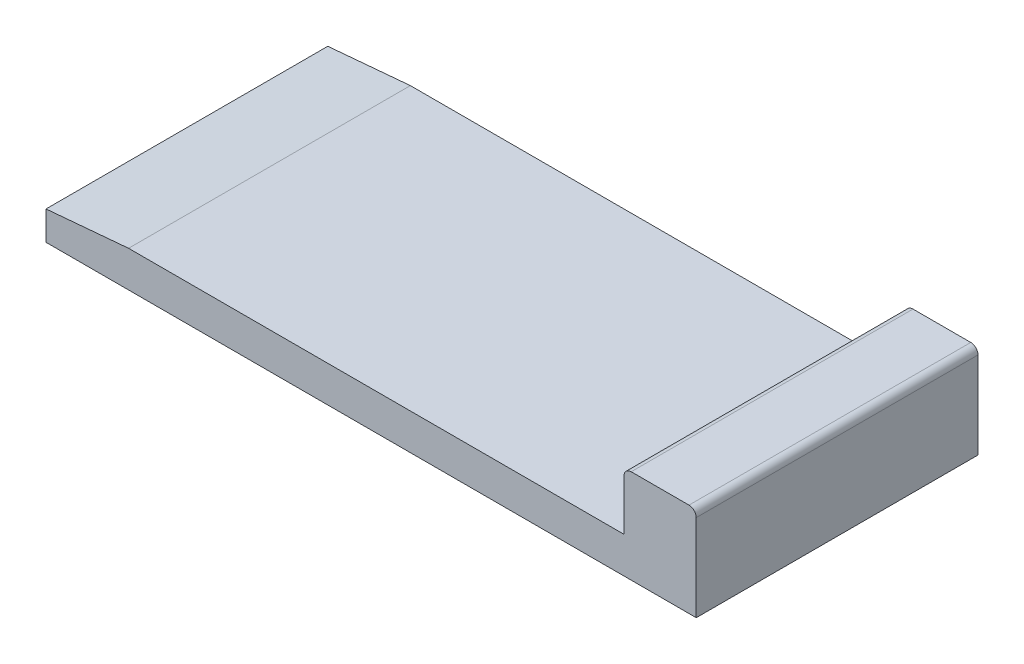
ISO-10303-21;
HEADER;
FILE_DESCRIPTION(('STEP AP214'),'2;1');
FILE_NAME('part.step','',(''),(''),'','','');
FILE_SCHEMA(('AUTOMOTIVE_DESIGN { 1 0 10303 214 1 1 1 1 }'));
ENDSEC;
DATA;
#1=APPLICATION_CONTEXT('core data for automotive mechanical design processes');
#2=APPLICATION_PROTOCOL_DEFINITION('international standard','automotive_design',2000,#1);
#3=PRODUCT_CONTEXT('',#1,'mechanical');
#4=PRODUCT('Part','Part','',(#3));
#5=PRODUCT_RELATED_PRODUCT_CATEGORY('part','',(#4));
#6=PRODUCT_DEFINITION_FORMATION('','',#4);
#7=PRODUCT_DEFINITION_CONTEXT('part definition',#1,'design');
#8=PRODUCT_DEFINITION('design','',#6,#7);
#9=PRODUCT_DEFINITION_SHAPE('','',#8);
#10=(LENGTH_UNIT() NAMED_UNIT(*) SI_UNIT(.MILLI.,.METRE.));
#11=(NAMED_UNIT(*) PLANE_ANGLE_UNIT() SI_UNIT($,.RADIAN.));
#12=(NAMED_UNIT(*) SI_UNIT($,.STERADIAN.) SOLID_ANGLE_UNIT());
#13=UNCERTAINTY_MEASURE_WITH_UNIT(LENGTH_MEASURE(1.E-05),#10,'distance_accuracy_value','');
#14=(GEOMETRIC_REPRESENTATION_CONTEXT(3) GLOBAL_UNCERTAINTY_ASSIGNED_CONTEXT((#13)) GLOBAL_UNIT_ASSIGNED_CONTEXT((#10,
#11,#12)) REPRESENTATION_CONTEXT('',''));
#15=CARTESIAN_POINT('',(0.,0.,0.));
#16=DIRECTION('',(0.,0.,1.));
#17=DIRECTION('',(1.,0.,0.));
#18=AXIS2_PLACEMENT_3D('',#15,#16,#17);
#19=CARTESIAN_POINT('',(-21.2148337595908,2.5,-8.61253196930946));
#20=DIRECTION('',(1.,0.,0.));
#21=DIRECTION('',(0.,0.,-1.));
#22=AXIS2_PLACEMENT_3D('',#19,#20,#21);
#23=PLANE('',#22);
#24=DIRECTION('',(0.,-1.,0.));
#25=VECTOR('',#24,1.);
#26=CARTESIAN_POINT('',(-21.2148337595908,2.5,10.8874680306905));
#27=LINE('',#26,#25);
#28=CARTESIAN_POINT('',(-21.2148337595908,2.,10.8874680306905));
#29=VERTEX_POINT('',#28);
#30=CARTESIAN_POINT('',(-21.2148337595908,0.,10.8874680306905));
#31=VERTEX_POINT('',#30);
#32=EDGE_CURVE('E154',#29,#31,#27,.T.);
#33=ORIENTED_EDGE('',*,*,#32,.F.);
#34=DIRECTION('',(0.,0.,-1.));
#35=VECTOR('',#34,1.);
#36=CARTESIAN_POINT('',(-21.2148337595908,2.,-8.61253196930946));
#37=LINE('',#36,#35);
#38=CARTESIAN_POINT('',(-21.2148337595908,2.,-8.61253196930946));
#39=VERTEX_POINT('',#38);
#40=EDGE_CURVE('E44',#29,#39,#37,.T.);
#41=ORIENTED_EDGE('',*,*,#40,.T.);
#42=DIRECTION('',(0.,-1.,0.));
#43=VECTOR('',#42,1.);
#44=CARTESIAN_POINT('',(-21.2148337595908,2.5,-8.61253196930946));
#45=LINE('',#44,#43);
#46=CARTESIAN_POINT('',(-21.2148337595908,0.,-8.61253196930946));
#47=VERTEX_POINT('',#46);
#48=EDGE_CURVE('E138',#39,#47,#45,.T.);
#49=ORIENTED_EDGE('',*,*,#48,.T.);
#50=DIRECTION('',(0.,0.,1.));
#51=VECTOR('',#50,1.);
#52=CARTESIAN_POINT('',(-21.2148337595908,0.,-8.61253196930946));
#53=LINE('',#52,#51);
#54=EDGE_CURVE('E135',#47,#31,#53,.T.);
#55=ORIENTED_EDGE('',*,*,#54,.T.);
#56=EDGE_LOOP('',(#33,#41,#49,#55));
#57=FACE_BOUND('',#56,.T.);
#58=ADVANCED_FACE('F35',(#57),#23,.F.);
#59=CARTESIAN_POINT('',(-21.2148337595908,2.5,10.8874680306905));
#60=DIRECTION('',(0.,0.,-1.));
#61=DIRECTION('',(-1.,0.,0.));
#62=AXIS2_PLACEMENT_3D('',#59,#60,#61);
#63=PLANE('',#62);
#64=DIRECTION('',(1.,0.,0.));
#65=VECTOR('',#64,1.);
#66=CARTESIAN_POINT('',(-21.2148337595908,2.5,10.8874680306905));
#67=LINE('',#66,#65);
#68=CARTESIAN_POINT('',(-15.4998076082104,2.5,10.8874680306905));
#69=VERTEX_POINT('',#68);
#70=CARTESIAN_POINT('',(18.7851662404092,2.5,10.8874680306905));
#71=VERTEX_POINT('',#70);
#72=EDGE_CURVE('E105',#69,#71,#67,.T.);
#73=ORIENTED_EDGE('',*,*,#72,.F.);
#74=DIRECTION('',(-0.996194698091745,-0.087155742747662,0.));
#75=VECTOR('',#74,1.);
#76=CARTESIAN_POINT('',(-15.4998076082104,2.5,10.8874680306905));
#77=LINE('',#76,#75);
#78=EDGE_CURVE('E58',#69,#29,#77,.T.);
#79=ORIENTED_EDGE('',*,*,#78,.T.);
#80=ORIENTED_EDGE('',*,*,#32,.T.);
#81=DIRECTION('',(1.,0.,0.));
#82=VECTOR('',#81,1.);
#83=CARTESIAN_POINT('',(-21.2148337595908,0.,10.8874680306905));
#84=LINE('',#83,#82);
#85=CARTESIAN_POINT('',(23.7851662404092,0.,10.8874680306905));
#86=VERTEX_POINT('',#85);
#87=EDGE_CURVE('E141',#31,#86,#84,.T.);
#88=ORIENTED_EDGE('',*,*,#87,.T.);
#89=DIRECTION('',(0.,-1.,0.));
#90=VECTOR('',#89,1.);
#91=CARTESIAN_POINT('',(23.7851662404092,2.5,10.8874680306905));
#92=LINE('',#91,#90);
#93=CARTESIAN_POINT('',(23.7851662404092,6.,10.8874680306905));
#94=VERTEX_POINT('',#93);
#95=EDGE_CURVE('E152',#94,#86,#92,.T.);
#96=ORIENTED_EDGE('',*,*,#95,.F.);
#97=CARTESIAN_POINT('',(23.2851662404092,6.,10.8874680306905));
#98=DIRECTION('',(0.,0.,-1.));
#99=DIRECTION('',(-1.,0.,0.));
#100=AXIS2_PLACEMENT_3D('',#97,#98,#99);
#101=CIRCLE('',#100,0.5);
#102=CARTESIAN_POINT('',(23.2851662404092,6.5,10.8874680306905));
#103=VERTEX_POINT('',#102);
#104=EDGE_CURVE('E162',#94,#103,#101,.F.);
#105=ORIENTED_EDGE('',*,*,#104,.T.);
#106=DIRECTION('',(1.,0.,0.));
#107=VECTOR('',#106,1.);
#108=CARTESIAN_POINT('',(23.7851662404092,6.5,10.8874680306905));
#109=LINE('',#108,#107);
#110=CARTESIAN_POINT('',(19.2851662404092,6.5,10.8874680306905));
#111=VERTEX_POINT('',#110);
#112=EDGE_CURVE('E125',#111,#103,#109,.T.);
#113=ORIENTED_EDGE('',*,*,#112,.F.);
#114=CARTESIAN_POINT('',(19.2851662404092,6.,10.8874680306905));
#115=DIRECTION('',(0.,0.,-1.));
#116=DIRECTION('',(-1.,0.,0.));
#117=AXIS2_PLACEMENT_3D('',#114,#115,#116);
#118=CIRCLE('',#117,0.5);
#119=CARTESIAN_POINT('',(18.7851662404092,6.,10.8874680306905));
#120=VERTEX_POINT('',#119);
#121=EDGE_CURVE('E121',#111,#120,#118,.F.);
#122=ORIENTED_EDGE('',*,*,#121,.T.);
#123=DIRECTION('',(0.,-1.,0.));
#124=VECTOR('',#123,1.);
#125=CARTESIAN_POINT('',(18.7851662404092,6.5,10.8874680306905));
#126=LINE('',#125,#124);
#127=EDGE_CURVE('E118',#120,#71,#126,.T.);
#128=ORIENTED_EDGE('',*,*,#127,.T.);
#129=EDGE_LOOP('',(#73,#79,#80,#88,#96,#105,#113,#122,#128));
#130=FACE_BOUND('',#129,.T.);
#131=ADVANCED_FACE('F119',(#130),#63,.F.);
#132=CARTESIAN_POINT('',(23.7851662404092,2.5,-8.61253196930946));
#133=DIRECTION('',(-1.,0.,0.));
#134=DIRECTION('',(0.,0.,1.));
#135=AXIS2_PLACEMENT_3D('',#132,#133,#134);
#136=PLANE('',#135);
#137=DIRECTION('',(0.,-1.,0.));
#138=VECTOR('',#137,1.);
#139=CARTESIAN_POINT('',(23.7851662404092,2.5,-8.61253196930946));
#140=LINE('',#139,#138);
#141=CARTESIAN_POINT('',(23.7851662404092,6.,-8.61253196930946));
#142=VERTEX_POINT('',#141);
#143=CARTESIAN_POINT('',(23.7851662404092,0.,-8.61253196930946));
#144=VERTEX_POINT('',#143);
#145=EDGE_CURVE('E150',#142,#144,#140,.T.);
#146=ORIENTED_EDGE('',*,*,#145,.F.);
#147=DIRECTION('',(0.,0.,-1.));
#148=VECTOR('',#147,1.);
#149=CARTESIAN_POINT('',(23.7851662404092,6.,-8.61253196930946));
#150=LINE('',#149,#148);
#151=EDGE_CURVE('E171',#142,#94,#150,.F.);
#152=ORIENTED_EDGE('',*,*,#151,.T.);
#153=ORIENTED_EDGE('',*,*,#95,.T.);
#154=DIRECTION('',(0.,0.,-1.));
#155=VECTOR('',#154,1.);
#156=CARTESIAN_POINT('',(23.7851662404092,0.,-8.61253196930946));
#157=LINE('',#156,#155);
#158=EDGE_CURVE('E144',#86,#144,#157,.T.);
#159=ORIENTED_EDGE('',*,*,#158,.T.);
#160=EDGE_LOOP('',(#146,#152,#153,#159));
#161=FACE_BOUND('',#160,.T.);
#162=ADVANCED_FACE('F178',(#161),#136,.F.);
#163=CARTESIAN_POINT('',(-21.2148337595908,2.5,-8.61253196930946));
#164=DIRECTION('',(0.,0.,1.));
#165=DIRECTION('',(1.,0.,0.));
#166=AXIS2_PLACEMENT_3D('',#163,#164,#165);
#167=PLANE('',#166);
#168=ORIENTED_EDGE('',*,*,#48,.F.);
#169=DIRECTION('',(0.996194698091745,0.087155742747662,0.));
#170=VECTOR('',#169,1.);
#171=CARTESIAN_POINT('',(-15.4998076082104,2.5,-8.61253196930946));
#172=LINE('',#171,#170);
#173=CARTESIAN_POINT('',(-15.4998076082104,2.5,-8.61253196930946));
#174=VERTEX_POINT('',#173);
#175=EDGE_CURVE('E11',#39,#174,#172,.T.);
#176=ORIENTED_EDGE('',*,*,#175,.T.);
#177=DIRECTION('',(-1.,0.,0.));
#178=VECTOR('',#177,1.);
#179=CARTESIAN_POINT('',(-21.2148337595908,2.5,-8.61253196930946));
#180=LINE('',#179,#178);
#181=CARTESIAN_POINT('',(18.7851662404092,2.5,-8.61253196930946));
#182=VERTEX_POINT('',#181);
#183=EDGE_CURVE('E114',#182,#174,#180,.T.);
#184=ORIENTED_EDGE('',*,*,#183,.F.);
#185=DIRECTION('',(0.,-1.,0.));
#186=VECTOR('',#185,1.);
#187=CARTESIAN_POINT('',(18.7851662404092,6.5,-8.61253196930946));
#188=LINE('',#187,#186);
#189=CARTESIAN_POINT('',(18.7851662404092,6.,-8.61253196930946));
#190=VERTEX_POINT('',#189);
#191=EDGE_CURVE('E124',#190,#182,#188,.T.);
#192=ORIENTED_EDGE('',*,*,#191,.F.);
#193=CARTESIAN_POINT('',(19.2851662404092,6.,-8.61253196930946));
#194=DIRECTION('',(0.,0.,1.));
#195=DIRECTION('',(1.,0.,0.));
#196=AXIS2_PLACEMENT_3D('',#193,#194,#195);
#197=CIRCLE('',#196,0.5);
#198=CARTESIAN_POINT('',(19.2851662404092,6.5,-8.61253196930946));
#199=VERTEX_POINT('',#198);
#200=EDGE_CURVE('E169',#190,#199,#197,.F.);
#201=ORIENTED_EDGE('',*,*,#200,.T.);
#202=DIRECTION('',(-1.,0.,0.));
#203=VECTOR('',#202,1.);
#204=CARTESIAN_POINT('',(23.7851662404092,6.5,-8.61253196930946));
#205=LINE('',#204,#203);
#206=CARTESIAN_POINT('',(23.2851662404092,6.5,-8.61253196930946));
#207=VERTEX_POINT('',#206);
#208=EDGE_CURVE('E129',#207,#199,#205,.T.);
#209=ORIENTED_EDGE('',*,*,#208,.F.);
#210=CARTESIAN_POINT('',(23.2851662404092,6.,-8.61253196930946));
#211=DIRECTION('',(0.,0.,1.));
#212=DIRECTION('',(1.,0.,0.));
#213=AXIS2_PLACEMENT_3D('',#210,#211,#212);
#214=CIRCLE('',#213,0.5);
#215=EDGE_CURVE('E167',#207,#142,#214,.F.);
#216=ORIENTED_EDGE('',*,*,#215,.T.);
#217=ORIENTED_EDGE('',*,*,#145,.T.);
#218=DIRECTION('',(-1.,0.,0.));
#219=VECTOR('',#218,1.);
#220=CARTESIAN_POINT('',(-21.2148337595908,0.,-8.61253196930946));
#221=LINE('',#220,#219);
#222=EDGE_CURVE('E115',#144,#47,#221,.T.);
#223=ORIENTED_EDGE('',*,*,#222,.T.);
#224=EDGE_LOOP('',(#168,#176,#184,#192,#201,#209,#216,#217,#223));
#225=FACE_BOUND('',#224,.T.);
#226=ADVANCED_FACE('F191',(#225),#167,.F.);
#227=CARTESIAN_POINT('',(0.,2.5,0.));
#228=DIRECTION('',(0.,1.,0.));
#229=DIRECTION('',(0.,0.,1.));
#230=AXIS2_PLACEMENT_3D('',#227,#228,#229);
#231=PLANE('',#230);
#232=ORIENTED_EDGE('',*,*,#183,.T.);
#233=DIRECTION('',(0.,0.,1.));
#234=VECTOR('',#233,1.);
#235=CARTESIAN_POINT('',(-15.4998076082104,2.5,10.8874680306905));
#236=LINE('',#235,#234);
#237=EDGE_CURVE('E113',#174,#69,#236,.T.);
#238=ORIENTED_EDGE('',*,*,#237,.T.);
#239=ORIENTED_EDGE('',*,*,#72,.T.);
#240=DIRECTION('',(0.,0.,1.));
#241=VECTOR('',#240,1.);
#242=CARTESIAN_POINT('',(18.7851662404092,2.5,-8.61253196930946));
#243=LINE('',#242,#241);
#244=EDGE_CURVE('E110',#182,#71,#243,.T.);
#245=ORIENTED_EDGE('',*,*,#244,.F.);
#246=EDGE_LOOP('',(#232,#238,#239,#245));
#247=FACE_BOUND('',#246,.T.);
#248=ADVANCED_FACE('F108',(#247),#231,.T.);
#249=CARTESIAN_POINT('',(0.,0.,0.));
#250=DIRECTION('',(0.,1.,0.));
#251=DIRECTION('',(0.,0.,1.));
#252=AXIS2_PLACEMENT_3D('',#249,#250,#251);
#253=PLANE('',#252);
#254=ORIENTED_EDGE('',*,*,#54,.F.);
#255=ORIENTED_EDGE('',*,*,#222,.F.);
#256=ORIENTED_EDGE('',*,*,#158,.F.);
#257=ORIENTED_EDGE('',*,*,#87,.F.);
#258=EDGE_LOOP('',(#254,#255,#256,#257));
#259=FACE_BOUND('',#258,.T.);
#260=ADVANCED_FACE('F213',(#259),#253,.F.);
#261=CARTESIAN_POINT('',(18.7851662404092,6.5,-8.61253196930946));
#262=DIRECTION('',(1.,0.,0.));
#263=DIRECTION('',(0.,0.,-1.));
#264=AXIS2_PLACEMENT_3D('',#261,#262,#263);
#265=PLANE('',#264);
#266=ORIENTED_EDGE('',*,*,#127,.F.);
#267=DIRECTION('',(0.,0.,1.));
#268=VECTOR('',#267,1.);
#269=CARTESIAN_POINT('',(18.7851662404092,6.,-8.61253196930946));
#270=LINE('',#269,#268);
#271=EDGE_CURVE('E165',#120,#190,#270,.F.);
#272=ORIENTED_EDGE('',*,*,#271,.T.);
#273=ORIENTED_EDGE('',*,*,#191,.T.);
#274=ORIENTED_EDGE('',*,*,#244,.T.);
#275=EDGE_LOOP('',(#266,#272,#273,#274));
#276=FACE_BOUND('',#275,.T.);
#277=ADVANCED_FACE('F127',(#276),#265,.F.);
#278=CARTESIAN_POINT('',(0.,6.5,0.));
#279=DIRECTION('',(0.,-1.,0.));
#280=DIRECTION('',(0.,0.,-1.));
#281=AXIS2_PLACEMENT_3D('',#278,#279,#280);
#282=PLANE('',#281);
#283=ORIENTED_EDGE('',*,*,#208,.T.);
#284=DIRECTION('',(0.,0.,1.));
#285=VECTOR('',#284,1.);
#286=CARTESIAN_POINT('',(19.2851662404092,6.5,0.));
#287=LINE('',#286,#285);
#288=EDGE_CURVE('E159',#199,#111,#287,.T.);
#289=ORIENTED_EDGE('',*,*,#288,.T.);
#290=ORIENTED_EDGE('',*,*,#112,.T.);
#291=DIRECTION('',(0.,0.,-1.));
#292=VECTOR('',#291,1.);
#293=CARTESIAN_POINT('',(23.2851662404092,6.5,0.));
#294=LINE('',#293,#292);
#295=EDGE_CURVE('E156',#103,#207,#294,.T.);
#296=ORIENTED_EDGE('',*,*,#295,.T.);
#297=EDGE_LOOP('',(#283,#289,#290,#296));
#298=FACE_BOUND('',#297,.T.);
#299=ADVANCED_FACE('F188',(#298),#282,.F.);
#300=CARTESIAN_POINT('',(19.2851662404092,6.,0.));
#301=DIRECTION('',(0.,0.,1.));
#302=DIRECTION('',(1.,0.,0.));
#303=AXIS2_PLACEMENT_3D('',#300,#301,#302);
#304=CYLINDRICAL_SURFACE('',#303,0.5);
#305=ORIENTED_EDGE('',*,*,#200,.F.);
#306=ORIENTED_EDGE('',*,*,#271,.F.);
#307=ORIENTED_EDGE('',*,*,#121,.F.);
#308=ORIENTED_EDGE('',*,*,#288,.F.);
#309=EDGE_LOOP('',(#305,#306,#307,#308));
#310=FACE_BOUND('',#309,.T.);
#311=ADVANCED_FACE('F194',(#310),#304,.T.);
#312=CARTESIAN_POINT('',(23.2851662404092,6.,0.));
#313=DIRECTION('',(0.,0.,-1.));
#314=DIRECTION('',(-1.,0.,0.));
#315=AXIS2_PLACEMENT_3D('',#312,#313,#314);
#316=CYLINDRICAL_SURFACE('',#315,0.5);
#317=ORIENTED_EDGE('',*,*,#104,.F.);
#318=ORIENTED_EDGE('',*,*,#151,.F.);
#319=ORIENTED_EDGE('',*,*,#215,.F.);
#320=ORIENTED_EDGE('',*,*,#295,.F.);
#321=EDGE_LOOP('',(#317,#318,#319,#320));
#322=FACE_BOUND('',#321,.T.);
#323=ADVANCED_FACE('F185',(#322),#316,.T.);
#324=CARTESIAN_POINT('',(-15.4998076082104,2.5,0.));
#325=DIRECTION('',(-0.087155742747662,0.996194698091745,0.));
#326=DIRECTION('',(0.,0.,-1.));
#327=AXIS2_PLACEMENT_3D('',#324,#325,#326);
#328=PLANE('',#327);
#329=ORIENTED_EDGE('',*,*,#175,.F.);
#330=ORIENTED_EDGE('',*,*,#40,.F.);
#331=ORIENTED_EDGE('',*,*,#78,.F.);
#332=ORIENTED_EDGE('',*,*,#237,.F.);
#333=EDGE_LOOP('',(#329,#330,#331,#332));
#334=FACE_BOUND('',#333,.T.);
#335=ADVANCED_FACE('F38',(#334),#328,.T.);
#336=CLOSED_SHELL('',(#58,#131,#162,#226,#248,#260,#277,#299,#311,#323,#335));
#337=MANIFOLD_SOLID_BREP('B2',#336);
#338=ADVANCED_BREP_SHAPE_REPRESENTATION('',(#18,#337),#14);
#339=SHAPE_DEFINITION_REPRESENTATION(#9,#338);
ENDSEC;
END-ISO-10303-21;
